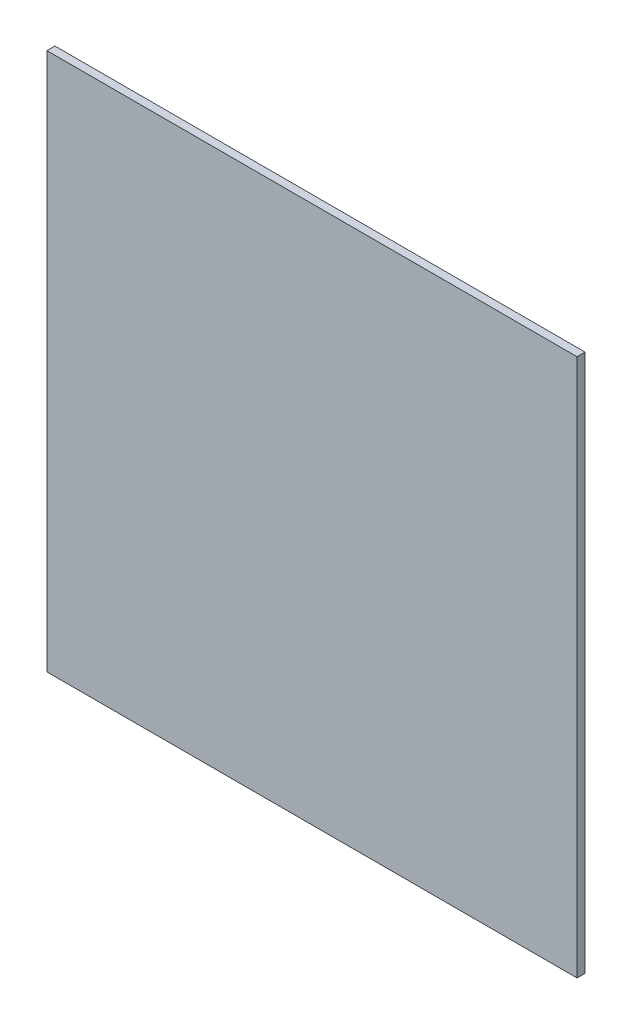
ISO-10303-21;
HEADER;
FILE_DESCRIPTION(('STEP AP214'),'2;1');
FILE_NAME('part.step','',(''),(''),'','','');
FILE_SCHEMA(('AUTOMOTIVE_DESIGN { 1 0 10303 214 1 1 1 1 }'));
ENDSEC;
DATA;
#1=APPLICATION_CONTEXT('core data for automotive mechanical design processes');
#2=APPLICATION_PROTOCOL_DEFINITION('international standard','automotive_design',2000,#1);
#3=PRODUCT_CONTEXT('',#1,'mechanical');
#4=PRODUCT('Part','Part','',(#3));
#5=PRODUCT_RELATED_PRODUCT_CATEGORY('part','',(#4));
#6=PRODUCT_DEFINITION_FORMATION('','',#4);
#7=PRODUCT_DEFINITION_CONTEXT('part definition',#1,'design');
#8=PRODUCT_DEFINITION('design','',#6,#7);
#9=PRODUCT_DEFINITION_SHAPE('','',#8);
#10=(LENGTH_UNIT() NAMED_UNIT(*) SI_UNIT(.MILLI.,.METRE.));
#11=(NAMED_UNIT(*) PLANE_ANGLE_UNIT() SI_UNIT($,.RADIAN.));
#12=(NAMED_UNIT(*) SI_UNIT($,.STERADIAN.) SOLID_ANGLE_UNIT());
#13=UNCERTAINTY_MEASURE_WITH_UNIT(LENGTH_MEASURE(1.E-05),#10,'distance_accuracy_value','');
#14=(GEOMETRIC_REPRESENTATION_CONTEXT(3) GLOBAL_UNCERTAINTY_ASSIGNED_CONTEXT((#13)) GLOBAL_UNIT_ASSIGNED_CONTEXT((#10,
#11,#12)) REPRESENTATION_CONTEXT('',''));
#15=CARTESIAN_POINT('',(0.,0.,0.));
#16=DIRECTION('',(0.,0.,1.));
#17=DIRECTION('',(1.,0.,0.));
#18=AXIS2_PLACEMENT_3D('',#15,#16,#17);
#19=CARTESIAN_POINT('',(3.3,0.456,0.05));
#20=DIRECTION('',(-1.,0.,0.));
#21=DIRECTION('',(0.,0.,1.));
#22=AXIS2_PLACEMENT_3D('',#19,#20,#21);
#23=PLANE('',#22);
#24=DIRECTION('',(0.,0.,-1.));
#25=VECTOR('',#24,1.);
#26=CARTESIAN_POINT('',(3.3,-2.893,0.05));
#27=LINE('',#26,#25);
#28=CARTESIAN_POINT('',(3.3,-2.893,0.1));
#29=VERTEX_POINT('',#28);
#30=CARTESIAN_POINT('',(3.3,-2.893,0.));
#31=VERTEX_POINT('',#30);
#32=EDGE_CURVE('E64',#29,#31,#27,.T.);
#33=ORIENTED_EDGE('',*,*,#32,.T.);
#34=DIRECTION('',(0.,-1.,0.));
#35=VECTOR('',#34,1.);
#36=CARTESIAN_POINT('',(3.3,0.456,0.));
#37=LINE('',#36,#35);
#38=CARTESIAN_POINT('',(3.3,3.805,0.));
#39=VERTEX_POINT('',#38);
#40=EDGE_CURVE('E90',#39,#31,#37,.T.);
#41=ORIENTED_EDGE('',*,*,#40,.F.);
#42=DIRECTION('',(0.,0.,-1.));
#43=VECTOR('',#42,1.);
#44=CARTESIAN_POINT('',(3.3,3.805,0.05));
#45=LINE('',#44,#43);
#46=CARTESIAN_POINT('',(3.3,3.805,0.1));
#47=VERTEX_POINT('',#46);
#48=EDGE_CURVE('E11',#47,#39,#45,.T.);
#49=ORIENTED_EDGE('',*,*,#48,.F.);
#50=DIRECTION('',(0.,1.,0.));
#51=VECTOR('',#50,1.);
#52=CARTESIAN_POINT('',(3.3,0.456,0.1));
#53=LINE('',#52,#51);
#54=EDGE_CURVE('E99',#29,#47,#53,.T.);
#55=ORIENTED_EDGE('',*,*,#54,.F.);
#56=EDGE_LOOP('',(#33,#41,#49,#55));
#57=FACE_BOUND('',#56,.T.);
#58=ADVANCED_FACE('F16',(#57),#23,.F.);
#59=CARTESIAN_POINT('',(0.,3.805,0.05));
#60=DIRECTION('',(0.,-1.,0.));
#61=DIRECTION('',(0.,0.,-1.));
#62=AXIS2_PLACEMENT_3D('',#59,#60,#61);
#63=PLANE('',#62);
#64=ORIENTED_EDGE('',*,*,#48,.T.);
#65=DIRECTION('',(1.,0.,0.));
#66=VECTOR('',#65,1.);
#67=CARTESIAN_POINT('',(0.,3.805,0.));
#68=LINE('',#67,#66);
#69=CARTESIAN_POINT('',(-3.3,3.805,0.));
#70=VERTEX_POINT('',#69);
#71=EDGE_CURVE('E83',#70,#39,#68,.T.);
#72=ORIENTED_EDGE('',*,*,#71,.F.);
#73=DIRECTION('',(0.,0.,-1.));
#74=VECTOR('',#73,1.);
#75=CARTESIAN_POINT('',(-3.3,3.805,0.05));
#76=LINE('',#75,#74);
#77=CARTESIAN_POINT('',(-3.3,3.805,0.1));
#78=VERTEX_POINT('',#77);
#79=EDGE_CURVE('E20',#78,#70,#76,.T.);
#80=ORIENTED_EDGE('',*,*,#79,.F.);
#81=DIRECTION('',(-1.,0.,0.));
#82=VECTOR('',#81,1.);
#83=CARTESIAN_POINT('',(0.,3.805,0.1));
#84=LINE('',#83,#82);
#85=EDGE_CURVE('E92',#47,#78,#84,.T.);
#86=ORIENTED_EDGE('',*,*,#85,.F.);
#87=EDGE_LOOP('',(#64,#72,#80,#86));
#88=FACE_BOUND('',#87,.T.);
#89=ADVANCED_FACE('F120',(#88),#63,.F.);
#90=CARTESIAN_POINT('',(-3.3,0.456,0.05));
#91=DIRECTION('',(1.,0.,0.));
#92=DIRECTION('',(0.,1.,0.));
#93=AXIS2_PLACEMENT_3D('',#90,#91,#92);
#94=PLANE('',#93);
#95=ORIENTED_EDGE('',*,*,#79,.T.);
#96=DIRECTION('',(0.,1.,0.));
#97=VECTOR('',#96,1.);
#98=CARTESIAN_POINT('',(-3.3,0.456,0.));
#99=LINE('',#98,#97);
#100=CARTESIAN_POINT('',(-3.3,-2.893,0.));
#101=VERTEX_POINT('',#100);
#102=EDGE_CURVE('E80',#101,#70,#99,.T.);
#103=ORIENTED_EDGE('',*,*,#102,.F.);
#104=DIRECTION('',(0.,0.,-1.));
#105=VECTOR('',#104,1.);
#106=CARTESIAN_POINT('',(-3.3,-2.893,0.05));
#107=LINE('',#106,#105);
#108=CARTESIAN_POINT('',(-3.3,-2.893,0.1));
#109=VERTEX_POINT('',#108);
#110=EDGE_CURVE('E74',#109,#101,#107,.T.);
#111=ORIENTED_EDGE('',*,*,#110,.F.);
#112=DIRECTION('',(0.,-1.,0.));
#113=VECTOR('',#112,1.);
#114=CARTESIAN_POINT('',(-3.3,0.456,0.1));
#115=LINE('',#114,#113);
#116=EDGE_CURVE('E77',#78,#109,#115,.T.);
#117=ORIENTED_EDGE('',*,*,#116,.F.);
#118=EDGE_LOOP('',(#95,#103,#111,#117));
#119=FACE_BOUND('',#118,.T.);
#120=ADVANCED_FACE('F75',(#119),#94,.F.);
#121=CARTESIAN_POINT('',(0.,-2.893,0.05));
#122=DIRECTION('',(0.,1.,0.));
#123=DIRECTION('',(1.,0.,0.));
#124=AXIS2_PLACEMENT_3D('',#121,#122,#123);
#125=PLANE('',#124);
#126=ORIENTED_EDGE('',*,*,#110,.T.);
#127=DIRECTION('',(-1.,0.,0.));
#128=VECTOR('',#127,1.);
#129=CARTESIAN_POINT('',(0.,-2.893,0.));
#130=LINE('',#129,#128);
#131=EDGE_CURVE('E106',#31,#101,#130,.T.);
#132=ORIENTED_EDGE('',*,*,#131,.F.);
#133=ORIENTED_EDGE('',*,*,#32,.F.);
#134=DIRECTION('',(1.,0.,0.));
#135=VECTOR('',#134,1.);
#136=CARTESIAN_POINT('',(0.,-2.893,0.1));
#137=LINE('',#136,#135);
#138=EDGE_CURVE('E85',#109,#29,#137,.T.);
#139=ORIENTED_EDGE('',*,*,#138,.F.);
#140=EDGE_LOOP('',(#126,#132,#133,#139));
#141=FACE_BOUND('',#140,.T.);
#142=ADVANCED_FACE('F86',(#141),#125,.F.);
#143=CARTESIAN_POINT('',(0.,0.456,0.));
#144=DIRECTION('',(0.,0.,1.));
#145=DIRECTION('',(1.,0.,0.));
#146=AXIS2_PLACEMENT_3D('',#143,#144,#145);
#147=PLANE('',#146);
#148=ORIENTED_EDGE('',*,*,#40,.T.);
#149=ORIENTED_EDGE('',*,*,#131,.T.);
#150=ORIENTED_EDGE('',*,*,#102,.T.);
#151=ORIENTED_EDGE('',*,*,#71,.T.);
#152=EDGE_LOOP('',(#148,#149,#150,#151));
#153=FACE_BOUND('',#152,.T.);
#154=ADVANCED_FACE('F118',(#153),#147,.F.);
#155=CARTESIAN_POINT('',(0.,0.456,0.1));
#156=DIRECTION('',(0.,0.,1.));
#157=DIRECTION('',(1.,0.,0.));
#158=AXIS2_PLACEMENT_3D('',#155,#156,#157);
#159=PLANE('',#158);
#160=ORIENTED_EDGE('',*,*,#54,.T.);
#161=ORIENTED_EDGE('',*,*,#85,.T.);
#162=ORIENTED_EDGE('',*,*,#116,.T.);
#163=ORIENTED_EDGE('',*,*,#138,.T.);
#164=EDGE_LOOP('',(#160,#161,#162,#163));
#165=FACE_BOUND('',#164,.T.);
#166=ADVANCED_FACE('F18',(#165),#159,.T.);
#167=CLOSED_SHELL('',(#58,#89,#120,#142,#154,#166));
#168=MANIFOLD_SOLID_BREP('B1',#167);
#169=ADVANCED_BREP_SHAPE_REPRESENTATION('',(#18,#168),#14);
#170=SHAPE_DEFINITION_REPRESENTATION(#9,#169);
ENDSEC;
END-ISO-10303-21;
